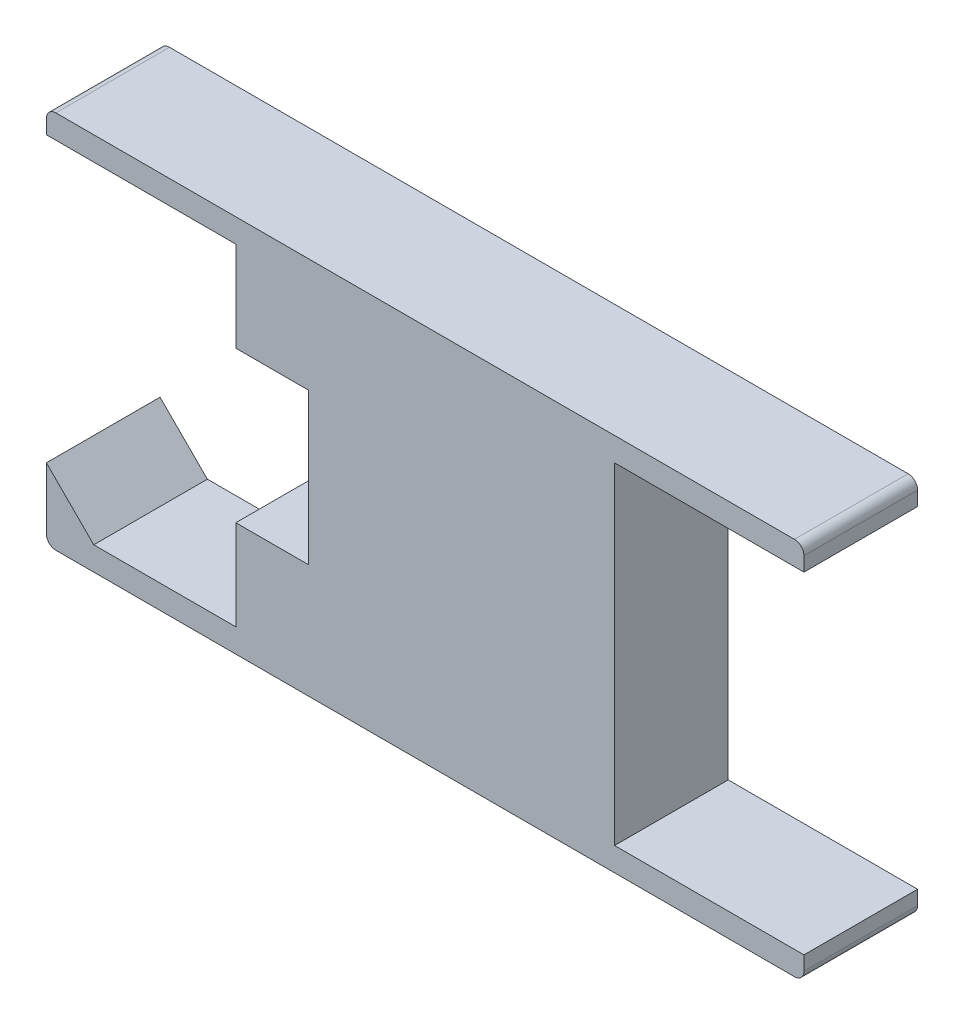
ISO-10303-21;
HEADER;
FILE_DESCRIPTION(('STEP AP214'),'2;1');
FILE_NAME('part.step','',(''),(''),'','','');
FILE_SCHEMA(('AUTOMOTIVE_DESIGN { 1 0 10303 214 1 1 1 1 }'));
ENDSEC;
DATA;
#1=APPLICATION_CONTEXT('core data for automotive mechanical design processes');
#2=APPLICATION_PROTOCOL_DEFINITION('international standard','automotive_design',2000,#1);
#3=PRODUCT_CONTEXT('',#1,'mechanical');
#4=PRODUCT('Part','Part','',(#3));
#5=PRODUCT_RELATED_PRODUCT_CATEGORY('part','',(#4));
#6=PRODUCT_DEFINITION_FORMATION('','',#4);
#7=PRODUCT_DEFINITION_CONTEXT('part definition',#1,'design');
#8=PRODUCT_DEFINITION('design','',#6,#7);
#9=PRODUCT_DEFINITION_SHAPE('','',#8);
#10=(LENGTH_UNIT() NAMED_UNIT(*) SI_UNIT(.MILLI.,.METRE.));
#11=(NAMED_UNIT(*) PLANE_ANGLE_UNIT() SI_UNIT($,.RADIAN.));
#12=(NAMED_UNIT(*) SI_UNIT($,.STERADIAN.) SOLID_ANGLE_UNIT());
#13=UNCERTAINTY_MEASURE_WITH_UNIT(LENGTH_MEASURE(1.E-05),#10,'distance_accuracy_value','');
#14=(GEOMETRIC_REPRESENTATION_CONTEXT(3) GLOBAL_UNCERTAINTY_ASSIGNED_CONTEXT((#13)) GLOBAL_UNIT_ASSIGNED_CONTEXT((#10,
#11,#12)) REPRESENTATION_CONTEXT('',''));
#15=CARTESIAN_POINT('',(0.,0.,0.));
#16=DIRECTION('',(0.,0.,1.));
#17=DIRECTION('',(1.,0.,0.));
#18=AXIS2_PLACEMENT_3D('',#15,#16,#17);
#19=CARTESIAN_POINT('',(0.78,-0.38,0.));
#20=DIRECTION('',(0.,0.,1.));
#21=DIRECTION('',(0.707106781186548,-0.707106781186548,0.));
#22=AXIS2_PLACEMENT_3D('',#19,#20,#21);
#23=CYLINDRICAL_SURFACE('',#22,0.02);
#24=CARTESIAN_POINT('',(0.78,-0.38,0.26));
#25=DIRECTION('',(0.,0.,-1.));
#26=DIRECTION('',(0.707106781186548,-0.707106781186548,0.));
#27=AXIS2_PLACEMENT_3D('',#24,#25,#26);
#28=CIRCLE('',#27,0.02);
#29=CARTESIAN_POINT('',(0.8,-0.38,0.26));
#30=VERTEX_POINT('',#29);
#31=CARTESIAN_POINT('',(0.78,-0.4,0.26));
#32=VERTEX_POINT('',#31);
#33=EDGE_CURVE('E11',#30,#32,#28,.T.);
#34=ORIENTED_EDGE('',*,*,#33,.T.);
#35=DIRECTION('',(0.,0.,-1.));
#36=VECTOR('',#35,1.);
#37=CARTESIAN_POINT('',(0.78,-0.4,0.));
#38=LINE('',#37,#36);
#39=CARTESIAN_POINT('',(0.78,-0.4,0.02));
#40=VERTEX_POINT('',#39);
#41=EDGE_CURVE('E28',#32,#40,#38,.T.);
#42=ORIENTED_EDGE('',*,*,#41,.T.);
#43=CARTESIAN_POINT('',(0.78,-0.38,0.02));
#44=DIRECTION('',(0.,0.,1.));
#45=DIRECTION('',(0.707106781186548,-0.707106781186548,0.));
#46=AXIS2_PLACEMENT_3D('',#43,#44,#45);
#47=CIRCLE('',#46,0.02);
#48=CARTESIAN_POINT('',(0.8,-0.38,0.02));
#49=VERTEX_POINT('',#48);
#50=EDGE_CURVE('E344',#40,#49,#47,.T.);
#51=ORIENTED_EDGE('',*,*,#50,.T.);
#52=DIRECTION('',(0.,0.,1.));
#53=VECTOR('',#52,1.);
#54=CARTESIAN_POINT('',(0.8,-0.38,0.));
#55=LINE('',#54,#53);
#56=EDGE_CURVE('E412',#49,#30,#55,.T.);
#57=ORIENTED_EDGE('',*,*,#56,.T.);
#58=EDGE_LOOP('',(#34,#42,#51,#57));
#59=FACE_BOUND('',#58,.T.);
#60=ADVANCED_FACE('F17',(#59),#23,.T.);
#61=CARTESIAN_POINT('',(-0.8,-0.4,0.));
#62=DIRECTION('',(0.,-1.,0.));
#63=DIRECTION('',(0.,0.,-1.));
#64=AXIS2_PLACEMENT_3D('',#61,#62,#63);
#65=PLANE('',#64);
#66=ORIENTED_EDGE('',*,*,#41,.F.);
#67=DIRECTION('',(-1.,0.,0.));
#68=VECTOR('',#67,1.);
#69=CARTESIAN_POINT('',(-0.4,-0.4,0.26));
#70=LINE('',#69,#68);
#71=CARTESIAN_POINT('',(-0.78,-0.4,0.26));
#72=VERTEX_POINT('',#71);
#73=EDGE_CURVE('E326',#32,#72,#70,.T.);
#74=ORIENTED_EDGE('',*,*,#73,.T.);
#75=DIRECTION('',(0.,0.,1.));
#76=VECTOR('',#75,1.);
#77=CARTESIAN_POINT('',(-0.78,-0.4,0.));
#78=LINE('',#77,#76);
#79=CARTESIAN_POINT('',(-0.78,-0.4,0.02));
#80=VERTEX_POINT('',#79);
#81=EDGE_CURVE('E267',#80,#72,#78,.T.);
#82=ORIENTED_EDGE('',*,*,#81,.F.);
#83=DIRECTION('',(1.,0.,0.));
#84=VECTOR('',#83,1.);
#85=CARTESIAN_POINT('',(-0.4,-0.4,0.02));
#86=LINE('',#85,#84);
#87=EDGE_CURVE('E323',#80,#40,#86,.T.);
#88=ORIENTED_EDGE('',*,*,#87,.T.);
#89=EDGE_LOOP('',(#66,#74,#82,#88));
#90=FACE_BOUND('',#89,.T.);
#91=ADVANCED_FACE('F504',(#90),#65,.T.);
#92=CARTESIAN_POINT('',(0.,0.,0.26));
#93=DIRECTION('',(0.,0.,-1.));
#94=DIRECTION('',(0.,-1.,0.));
#95=AXIS2_PLACEMENT_3D('',#92,#93,#94);
#96=PLANE('',#95);
#97=ORIENTED_EDGE('',*,*,#33,.F.);
#98=DIRECTION('',(0.,-1.,0.));
#99=VECTOR('',#98,1.);
#100=CARTESIAN_POINT('',(0.8,-0.2,0.26));
#101=LINE('',#100,#99);
#102=CARTESIAN_POINT('',(0.8,-0.35,0.26));
#103=VERTEX_POINT('',#102);
#104=EDGE_CURVE('E255',#103,#30,#101,.T.);
#105=ORIENTED_EDGE('',*,*,#104,.F.);
#106=DIRECTION('',(1.,0.,0.));
#107=VECTOR('',#106,1.);
#108=CARTESIAN_POINT('',(0.4,-0.35,0.26));
#109=LINE('',#108,#107);
#110=CARTESIAN_POINT('',(0.4,-0.35,0.26));
#111=VERTEX_POINT('',#110);
#112=EDGE_CURVE('E289',#111,#103,#109,.T.);
#113=ORIENTED_EDGE('',*,*,#112,.F.);
#114=DIRECTION('',(0.,-1.,0.));
#115=VECTOR('',#114,1.);
#116=CARTESIAN_POINT('',(0.4,-0.175,0.26));
#117=LINE('',#116,#115);
#118=CARTESIAN_POINT('',(0.4,0.35,0.26));
#119=VERTEX_POINT('',#118);
#120=EDGE_CURVE('E230',#119,#111,#117,.T.);
#121=ORIENTED_EDGE('',*,*,#120,.F.);
#122=DIRECTION('',(-1.,0.,0.));
#123=VECTOR('',#122,1.);
#124=CARTESIAN_POINT('',(0.2,0.35,0.26));
#125=LINE('',#124,#123);
#126=CARTESIAN_POINT('',(0.8,0.35,0.26));
#127=VERTEX_POINT('',#126);
#128=EDGE_CURVE('E217',#127,#119,#125,.T.);
#129=ORIENTED_EDGE('',*,*,#128,.F.);
#130=DIRECTION('',(0.,-1.,0.));
#131=VECTOR('',#130,1.);
#132=CARTESIAN_POINT('',(0.8,-0.2,0.26));
#133=LINE('',#132,#131);
#134=CARTESIAN_POINT('',(0.8,0.38,0.26));
#135=VERTEX_POINT('',#134);
#136=EDGE_CURVE('E290',#135,#127,#133,.T.);
#137=ORIENTED_EDGE('',*,*,#136,.F.);
#138=CARTESIAN_POINT('',(0.78,0.38,0.26));
#139=DIRECTION('',(0.,0.,-1.));
#140=DIRECTION('',(0.707106781186548,0.707106781186548,0.));
#141=AXIS2_PLACEMENT_3D('',#138,#139,#140);
#142=CIRCLE('',#141,0.02);
#143=CARTESIAN_POINT('',(0.78,0.4,0.26));
#144=VERTEX_POINT('',#143);
#145=EDGE_CURVE('E327',#144,#135,#142,.T.);
#146=ORIENTED_EDGE('',*,*,#145,.F.);
#147=DIRECTION('',(1.,0.,0.));
#148=VECTOR('',#147,1.);
#149=CARTESIAN_POINT('',(0.4,0.4,0.26));
#150=LINE('',#149,#148);
#151=CARTESIAN_POINT('',(-0.78,0.4,0.26));
#152=VERTEX_POINT('',#151);
#153=EDGE_CURVE('E331',#152,#144,#150,.T.);
#154=ORIENTED_EDGE('',*,*,#153,.F.);
#155=CARTESIAN_POINT('',(-0.78,0.38,0.26));
#156=DIRECTION('',(0.,0.,-1.));
#157=DIRECTION('',(-0.707106781186548,0.707106781186548,0.));
#158=AXIS2_PLACEMENT_3D('',#155,#156,#157);
#159=CIRCLE('',#158,0.02);
#160=CARTESIAN_POINT('',(-0.8,0.38,0.26));
#161=VERTEX_POINT('',#160);
#162=EDGE_CURVE('E316',#161,#152,#159,.T.);
#163=ORIENTED_EDGE('',*,*,#162,.F.);
#164=DIRECTION('',(0.,1.,0.));
#165=VECTOR('',#164,1.);
#166=CARTESIAN_POINT('',(-0.8,0.2,0.26));
#167=LINE('',#166,#165);
#168=CARTESIAN_POINT('',(-0.8,0.35,0.26));
#169=VERTEX_POINT('',#168);
#170=EDGE_CURVE('E337',#169,#161,#167,.T.);
#171=ORIENTED_EDGE('',*,*,#170,.F.);
#172=DIRECTION('',(-1.,0.,0.));
#173=VECTOR('',#172,1.);
#174=CARTESIAN_POINT('',(-0.4,0.35,0.26));
#175=LINE('',#174,#173);
#176=CARTESIAN_POINT('',(-0.4,0.35,0.26));
#177=VERTEX_POINT('',#176);
#178=EDGE_CURVE('E222',#177,#169,#175,.T.);
#179=ORIENTED_EDGE('',*,*,#178,.F.);
#180=DIRECTION('',(0.,1.,0.));
#181=VECTOR('',#180,1.);
#182=CARTESIAN_POINT('',(-0.4,0.175,0.26));
#183=LINE('',#182,#181);
#184=CARTESIAN_POINT('',(-0.4,0.159603540156,0.26));
#185=VERTEX_POINT('',#184);
#186=EDGE_CURVE('E246',#185,#177,#183,.T.);
#187=ORIENTED_EDGE('',*,*,#186,.F.);
#188=DIRECTION('',(-1.,0.,0.));
#189=VECTOR('',#188,1.);
#190=CARTESIAN_POINT('',(-0.2,0.159603540156,0.26));
#191=LINE('',#190,#189);
#192=CARTESIAN_POINT('',(-0.246794344933,0.159603540156,0.26));
#193=VERTEX_POINT('',#192);
#194=EDGE_CURVE('E365',#193,#185,#191,.T.);
#195=ORIENTED_EDGE('',*,*,#194,.F.);
#196=DIRECTION('',(0.,1.,0.));
#197=VECTOR('',#196,1.);
#198=CARTESIAN_POINT('',(-0.246794344933,0.07980177007817,0.26));
#199=LINE('',#198,#197);
#200=CARTESIAN_POINT('',(-0.246794344933,-0.159603540156,0.26));
#201=VERTEX_POINT('',#200);
#202=EDGE_CURVE('E300',#201,#193,#199,.T.);
#203=ORIENTED_EDGE('',*,*,#202,.F.);
#204=DIRECTION('',(1.,0.,0.));
#205=VECTOR('',#204,1.);
#206=CARTESIAN_POINT('',(-0.123397172466,-0.159603540156,0.26));
#207=LINE('',#206,#205);
#208=CARTESIAN_POINT('',(-0.4,-0.159603540156,0.26));
#209=VERTEX_POINT('',#208);
#210=EDGE_CURVE('E153',#209,#201,#207,.T.);
#211=ORIENTED_EDGE('',*,*,#210,.F.);
#212=DIRECTION('',(0.,1.,0.));
#213=VECTOR('',#212,1.);
#214=CARTESIAN_POINT('',(-0.4,-0.07980177007817,0.26));
#215=LINE('',#214,#213);
#216=CARTESIAN_POINT('',(-0.4,-0.35,0.26));
#217=VERTEX_POINT('',#216);
#218=EDGE_CURVE('E160',#217,#209,#215,.T.);
#219=ORIENTED_EDGE('',*,*,#218,.F.);
#220=DIRECTION('',(1.,0.,0.));
#221=VECTOR('',#220,1.);
#222=CARTESIAN_POINT('',(-0.2,-0.35,0.26));
#223=LINE('',#222,#221);
#224=CARTESIAN_POINT('',(-0.7,-0.35,0.26));
#225=VERTEX_POINT('',#224);
#226=EDGE_CURVE('E256',#225,#217,#223,.T.);
#227=ORIENTED_EDGE('',*,*,#226,.F.);
#228=DIRECTION('',(0.707106781186548,-0.707106781186548,0.));
#229=VECTOR('',#228,1.);
#230=CARTESIAN_POINT('',(-0.6125,-0.4375,0.26));
#231=LINE('',#230,#229);
#232=CARTESIAN_POINT('',(-0.8,-0.25,0.26));
#233=VERTEX_POINT('',#232);
#234=EDGE_CURVE('E251',#233,#225,#231,.T.);
#235=ORIENTED_EDGE('',*,*,#234,.F.);
#236=DIRECTION('',(0.,1.,0.));
#237=VECTOR('',#236,1.);
#238=CARTESIAN_POINT('',(-0.8,0.2,0.26));
#239=LINE('',#238,#237);
#240=CARTESIAN_POINT('',(-0.8,-0.38,0.26));
#241=VERTEX_POINT('',#240);
#242=EDGE_CURVE('E399',#241,#233,#239,.T.);
#243=ORIENTED_EDGE('',*,*,#242,.F.);
#244=CARTESIAN_POINT('',(-0.78,-0.38,0.26));
#245=DIRECTION('',(0.,0.,-1.));
#246=DIRECTION('',(-0.707106781186548,-0.707106781186548,0.));
#247=AXIS2_PLACEMENT_3D('',#244,#245,#246);
#248=CIRCLE('',#247,0.02);
#249=EDGE_CURVE('E21',#72,#241,#248,.T.);
#250=ORIENTED_EDGE('',*,*,#249,.F.);
#251=ORIENTED_EDGE('',*,*,#73,.F.);
#252=EDGE_LOOP('',(#97,#105,#113,#121,#129,#137,#146,#154,#163,#171,#179,#187,#195,#203,#211,
#219,#227,#235,#243,#250,#251));
#253=FACE_BOUND('',#252,.T.);
#254=ADVANCED_FACE('F445',(#253),#96,.F.);
#255=CARTESIAN_POINT('',(0.78,0.38,0.));
#256=DIRECTION('',(0.,0.,1.));
#257=DIRECTION('',(0.707106781186548,0.707106781186548,0.));
#258=AXIS2_PLACEMENT_3D('',#255,#256,#257);
#259=CYLINDRICAL_SURFACE('',#258,0.02);
#260=ORIENTED_EDGE('',*,*,#145,.T.);
#261=DIRECTION('',(0.,0.,-1.));
#262=VECTOR('',#261,1.);
#263=CARTESIAN_POINT('',(0.8,0.38,0.));
#264=LINE('',#263,#262);
#265=CARTESIAN_POINT('',(0.8,0.38,0.02));
#266=VERTEX_POINT('',#265);
#267=EDGE_CURVE('E383',#135,#266,#264,.T.);
#268=ORIENTED_EDGE('',*,*,#267,.T.);
#269=CARTESIAN_POINT('',(0.78,0.38,0.02));
#270=DIRECTION('',(0.,0.,1.));
#271=DIRECTION('',(0.707106781186548,0.707106781186548,0.));
#272=AXIS2_PLACEMENT_3D('',#269,#270,#271);
#273=CIRCLE('',#272,0.02);
#274=CARTESIAN_POINT('',(0.78,0.4,0.02));
#275=VERTEX_POINT('',#274);
#276=EDGE_CURVE('E275',#266,#275,#273,.T.);
#277=ORIENTED_EDGE('',*,*,#276,.T.);
#278=DIRECTION('',(0.,0.,1.));
#279=VECTOR('',#278,1.);
#280=CARTESIAN_POINT('',(0.78,0.4,0.));
#281=LINE('',#280,#279);
#282=EDGE_CURVE('E271',#275,#144,#281,.T.);
#283=ORIENTED_EDGE('',*,*,#282,.T.);
#284=EDGE_LOOP('',(#260,#268,#277,#283));
#285=FACE_BOUND('',#284,.T.);
#286=ADVANCED_FACE('F442',(#285),#259,.T.);
#287=CARTESIAN_POINT('',(0.8,0.4,0.));
#288=DIRECTION('',(0.,1.,0.));
#289=DIRECTION('',(1.,0.,0.));
#290=AXIS2_PLACEMENT_3D('',#287,#288,#289);
#291=PLANE('',#290);
#292=ORIENTED_EDGE('',*,*,#282,.F.);
#293=DIRECTION('',(-1.,0.,0.));
#294=VECTOR('',#293,1.);
#295=CARTESIAN_POINT('',(0.4,0.4,0.02));
#296=LINE('',#295,#294);
#297=CARTESIAN_POINT('',(-0.78,0.4,0.02));
#298=VERTEX_POINT('',#297);
#299=EDGE_CURVE('E276',#275,#298,#296,.T.);
#300=ORIENTED_EDGE('',*,*,#299,.T.);
#301=DIRECTION('',(0.,0.,-1.));
#302=VECTOR('',#301,1.);
#303=CARTESIAN_POINT('',(-0.78,0.4,0.));
#304=LINE('',#303,#302);
#305=EDGE_CURVE('E314',#152,#298,#304,.T.);
#306=ORIENTED_EDGE('',*,*,#305,.F.);
#307=ORIENTED_EDGE('',*,*,#153,.T.);
#308=EDGE_LOOP('',(#292,#300,#306,#307));
#309=FACE_BOUND('',#308,.T.);
#310=ADVANCED_FACE('F490',(#309),#291,.T.);
#311=CARTESIAN_POINT('',(-0.78,0.38,0.));
#312=DIRECTION('',(0.,0.,1.));
#313=DIRECTION('',(-0.707106781186548,0.707106781186548,0.));
#314=AXIS2_PLACEMENT_3D('',#311,#312,#313);
#315=CYLINDRICAL_SURFACE('',#314,0.02);
#316=ORIENTED_EDGE('',*,*,#162,.T.);
#317=ORIENTED_EDGE('',*,*,#305,.T.);
#318=CARTESIAN_POINT('',(-0.78,0.38,0.02));
#319=DIRECTION('',(0.,0.,1.));
#320=DIRECTION('',(-0.707106781186548,0.707106781186548,0.));
#321=AXIS2_PLACEMENT_3D('',#318,#319,#320);
#322=CIRCLE('',#321,0.02);
#323=CARTESIAN_POINT('',(-0.8,0.38,0.02));
#324=VERTEX_POINT('',#323);
#325=EDGE_CURVE('E313',#298,#324,#322,.T.);
#326=ORIENTED_EDGE('',*,*,#325,.T.);
#327=DIRECTION('',(0.,0.,1.));
#328=VECTOR('',#327,1.);
#329=CARTESIAN_POINT('',(-0.8,0.38,0.));
#330=LINE('',#329,#328);
#331=EDGE_CURVE('E309',#324,#161,#330,.T.);
#332=ORIENTED_EDGE('',*,*,#331,.T.);
#333=EDGE_LOOP('',(#316,#317,#326,#332));
#334=FACE_BOUND('',#333,.T.);
#335=ADVANCED_FACE('F480',(#334),#315,.T.);
#336=CARTESIAN_POINT('',(-0.78,-0.38,0.));
#337=DIRECTION('',(0.,0.,1.));
#338=DIRECTION('',(-0.707106781186548,-0.707106781186548,0.));
#339=AXIS2_PLACEMENT_3D('',#336,#337,#338);
#340=CYLINDRICAL_SURFACE('',#339,0.02);
#341=ORIENTED_EDGE('',*,*,#249,.T.);
#342=DIRECTION('',(0.,0.,-1.));
#343=VECTOR('',#342,1.);
#344=CARTESIAN_POINT('',(-0.8,-0.38,0.));
#345=LINE('',#344,#343);
#346=CARTESIAN_POINT('',(-0.8,-0.38,0.02));
#347=VERTEX_POINT('',#346);
#348=EDGE_CURVE('E266',#241,#347,#345,.T.);
#349=ORIENTED_EDGE('',*,*,#348,.T.);
#350=CARTESIAN_POINT('',(-0.78,-0.38,0.02));
#351=DIRECTION('',(0.,0.,1.));
#352=DIRECTION('',(-0.707106781186548,-0.707106781186548,0.));
#353=AXIS2_PLACEMENT_3D('',#350,#351,#352);
#354=CIRCLE('',#353,0.02);
#355=EDGE_CURVE('E262',#347,#80,#354,.T.);
#356=ORIENTED_EDGE('',*,*,#355,.T.);
#357=ORIENTED_EDGE('',*,*,#81,.T.);
#358=EDGE_LOOP('',(#341,#349,#356,#357));
#359=FACE_BOUND('',#358,.T.);
#360=ADVANCED_FACE('F498',(#359),#340,.T.);
#361=CARTESIAN_POINT('',(-0.8,0.4,0.));
#362=DIRECTION('',(-1.,0.,0.));
#363=DIRECTION('',(0.,0.,1.));
#364=AXIS2_PLACEMENT_3D('',#361,#362,#363);
#365=PLANE('',#364);
#366=ORIENTED_EDGE('',*,*,#348,.F.);
#367=ORIENTED_EDGE('',*,*,#242,.T.);
#368=DIRECTION('',(0.,0.,-1.));
#369=VECTOR('',#368,1.);
#370=CARTESIAN_POINT('',(-0.8,-0.25,0.));
#371=LINE('',#370,#369);
#372=CARTESIAN_POINT('',(-0.8,-0.25,0.02));
#373=VERTEX_POINT('',#372);
#374=EDGE_CURVE('E308',#233,#373,#371,.T.);
#375=ORIENTED_EDGE('',*,*,#374,.T.);
#376=DIRECTION('',(0.,-1.,0.));
#377=VECTOR('',#376,1.);
#378=CARTESIAN_POINT('',(-0.8,0.2,0.02));
#379=LINE('',#378,#377);
#380=EDGE_CURVE('E304',#373,#347,#379,.T.);
#381=ORIENTED_EDGE('',*,*,#380,.T.);
#382=EDGE_LOOP('',(#366,#367,#375,#381));
#383=FACE_BOUND('',#382,.T.);
#384=ADVANCED_FACE('F556',(#383),#365,.T.);
#385=CARTESIAN_POINT('',(0.8,-0.35,0.));
#386=DIRECTION('',(0.,-1.,0.));
#387=DIRECTION('',(0.,0.,-1.));
#388=AXIS2_PLACEMENT_3D('',#385,#386,#387);
#389=PLANE('',#388);
#390=ORIENTED_EDGE('',*,*,#112,.T.);
#391=DIRECTION('',(0.,0.,1.));
#392=VECTOR('',#391,1.);
#393=CARTESIAN_POINT('',(0.8,-0.35,0.));
#394=LINE('',#393,#392);
#395=CARTESIAN_POINT('',(0.8,-0.35,0.02));
#396=VERTEX_POINT('',#395);
#397=EDGE_CURVE('E284',#396,#103,#394,.T.);
#398=ORIENTED_EDGE('',*,*,#397,.F.);
#399=DIRECTION('',(1.,0.,0.));
#400=VECTOR('',#399,1.);
#401=CARTESIAN_POINT('',(0.8,-0.35,0.02));
#402=LINE('',#401,#400);
#403=CARTESIAN_POINT('',(0.4,-0.35,0.02));
#404=VERTEX_POINT('',#403);
#405=EDGE_CURVE('E395',#404,#396,#402,.T.);
#406=ORIENTED_EDGE('',*,*,#405,.F.);
#407=DIRECTION('',(0.,0.,-1.));
#408=VECTOR('',#407,1.);
#409=CARTESIAN_POINT('',(0.4,-0.35,0.));
#410=LINE('',#409,#408);
#411=EDGE_CURVE('E235',#111,#404,#410,.T.);
#412=ORIENTED_EDGE('',*,*,#411,.F.);
#413=EDGE_LOOP('',(#390,#398,#406,#412));
#414=FACE_BOUND('',#413,.T.);
#415=ADVANCED_FACE('F408',(#414),#389,.F.);
#416=CARTESIAN_POINT('',(0.8,-0.4,0.));
#417=DIRECTION('',(1.,0.,0.));
#418=DIRECTION('',(0.,1.,0.));
#419=AXIS2_PLACEMENT_3D('',#416,#417,#418);
#420=PLANE('',#419);
#421=ORIENTED_EDGE('',*,*,#56,.F.);
#422=DIRECTION('',(0.,1.,0.));
#423=VECTOR('',#422,1.);
#424=CARTESIAN_POINT('',(0.8,-0.2,0.02));
#425=LINE('',#424,#423);
#426=EDGE_CURVE('E285',#49,#396,#425,.T.);
#427=ORIENTED_EDGE('',*,*,#426,.T.);
#428=ORIENTED_EDGE('',*,*,#397,.T.);
#429=ORIENTED_EDGE('',*,*,#104,.T.);
#430=EDGE_LOOP('',(#421,#427,#428,#429));
#431=FACE_BOUND('',#430,.T.);
#432=ADVANCED_FACE('F411',(#431),#420,.T.);
#433=CARTESIAN_POINT('',(-0.7,-0.35,0.));
#434=DIRECTION('',(-0.707106781186548,-0.707106781186548,0.));
#435=DIRECTION('',(-0.707106781186548,0.707106781186548,0.));
#436=AXIS2_PLACEMENT_3D('',#433,#434,#435);
#437=PLANE('',#436);
#438=ORIENTED_EDGE('',*,*,#234,.T.);
#439=DIRECTION('',(0.,0.,1.));
#440=VECTOR('',#439,1.);
#441=CARTESIAN_POINT('',(-0.7,-0.35,0.));
#442=LINE('',#441,#440);
#443=CARTESIAN_POINT('',(-0.7,-0.35,0.02));
#444=VERTEX_POINT('',#443);
#445=EDGE_CURVE('E371',#444,#225,#442,.T.);
#446=ORIENTED_EDGE('',*,*,#445,.F.);
#447=DIRECTION('',(0.707106781186548,-0.707106781186548,0.));
#448=VECTOR('',#447,1.);
#449=CARTESIAN_POINT('',(-0.6375,-0.4125,0.02));
#450=LINE('',#449,#448);
#451=EDGE_CURVE('E340',#373,#444,#450,.T.);
#452=ORIENTED_EDGE('',*,*,#451,.F.);
#453=ORIENTED_EDGE('',*,*,#374,.F.);
#454=EDGE_LOOP('',(#438,#446,#452,#453));
#455=FACE_BOUND('',#454,.T.);
#456=ADVANCED_FACE('F511',(#455),#437,.F.);
#457=CARTESIAN_POINT('',(-0.4,-0.35,0.));
#458=DIRECTION('',(0.,-1.,0.));
#459=DIRECTION('',(-1.,0.,0.));
#460=AXIS2_PLACEMENT_3D('',#457,#458,#459);
#461=PLANE('',#460);
#462=ORIENTED_EDGE('',*,*,#226,.T.);
#463=DIRECTION('',(0.,0.,1.));
#464=VECTOR('',#463,1.);
#465=CARTESIAN_POINT('',(-0.4,-0.35,0.));
#466=LINE('',#465,#464);
#467=CARTESIAN_POINT('',(-0.4,-0.35,0.02));
#468=VERTEX_POINT('',#467);
#469=EDGE_CURVE('E380',#468,#217,#466,.T.);
#470=ORIENTED_EDGE('',*,*,#469,.F.);
#471=DIRECTION('',(1.,0.,0.));
#472=VECTOR('',#471,1.);
#473=CARTESIAN_POINT('',(0.8,-0.35,0.02));
#474=LINE('',#473,#472);
#475=EDGE_CURVE('E260',#444,#468,#474,.T.);
#476=ORIENTED_EDGE('',*,*,#475,.F.);
#477=ORIENTED_EDGE('',*,*,#445,.T.);
#478=EDGE_LOOP('',(#462,#470,#476,#477));
#479=FACE_BOUND('',#478,.T.);
#480=ADVANCED_FACE('F535',(#479),#461,.F.);
#481=CARTESIAN_POINT('',(-0.4,-0.159603540156,0.));
#482=DIRECTION('',(1.,0.,0.));
#483=DIRECTION('',(0.,1.,0.));
#484=AXIS2_PLACEMENT_3D('',#481,#482,#483);
#485=PLANE('',#484);
#486=ORIENTED_EDGE('',*,*,#218,.T.);
#487=DIRECTION('',(0.,0.,-1.));
#488=VECTOR('',#487,1.);
#489=CARTESIAN_POINT('',(-0.4,-0.159603540156,0.));
#490=LINE('',#489,#488);
#491=CARTESIAN_POINT('',(-0.4,-0.159603540156,0.02));
#492=VERTEX_POINT('',#491);
#493=EDGE_CURVE('E379',#209,#492,#490,.T.);
#494=ORIENTED_EDGE('',*,*,#493,.T.);
#495=DIRECTION('',(0.,-1.,0.));
#496=VECTOR('',#495,1.);
#497=CARTESIAN_POINT('',(-0.4,-0.503670619885,0.02));
#498=LINE('',#497,#496);
#499=EDGE_CURVE('E375',#492,#468,#498,.T.);
#500=ORIENTED_EDGE('',*,*,#499,.T.);
#501=ORIENTED_EDGE('',*,*,#469,.T.);
#502=EDGE_LOOP('',(#486,#494,#500,#501));
#503=FACE_BOUND('',#502,.T.);
#504=ADVANCED_FACE('F528',(#503),#485,.F.);
#505=CARTESIAN_POINT('',(-0.246794344933,-0.159603540156,0.));
#506=DIRECTION('',(0.,-1.,0.));
#507=DIRECTION('',(0.,0.,-1.));
#508=AXIS2_PLACEMENT_3D('',#505,#506,#507);
#509=PLANE('',#508);
#510=ORIENTED_EDGE('',*,*,#210,.T.);
#511=DIRECTION('',(0.,0.,1.));
#512=VECTOR('',#511,1.);
#513=CARTESIAN_POINT('',(-0.246794344933,-0.159603540156,0.));
#514=LINE('',#513,#512);
#515=CARTESIAN_POINT('',(-0.246794344933,-0.159603540156,0.02));
#516=VERTEX_POINT('',#515);
#517=EDGE_CURVE('E245',#516,#201,#514,.T.);
#518=ORIENTED_EDGE('',*,*,#517,.F.);
#519=DIRECTION('',(1.,0.,0.));
#520=VECTOR('',#519,1.);
#521=CARTESIAN_POINT('',(-0.276602827534,-0.159603540156,0.02));
#522=LINE('',#521,#520);
#523=EDGE_CURVE('E257',#492,#516,#522,.T.);
#524=ORIENTED_EDGE('',*,*,#523,.F.);
#525=ORIENTED_EDGE('',*,*,#493,.F.);
#526=EDGE_LOOP('',(#510,#518,#524,#525));
#527=FACE_BOUND('',#526,.T.);
#528=ADVANCED_FACE('F526',(#527),#509,.F.);
#529=CARTESIAN_POINT('',(0.4,0.35,0.));
#530=DIRECTION('',(0.,1.,0.));
#531=DIRECTION('',(1.,0.,0.));
#532=AXIS2_PLACEMENT_3D('',#529,#530,#531);
#533=PLANE('',#532);
#534=ORIENTED_EDGE('',*,*,#128,.T.);
#535=DIRECTION('',(0.,0.,1.));
#536=VECTOR('',#535,1.);
#537=CARTESIAN_POINT('',(0.4,0.35,0.));
#538=LINE('',#537,#536);
#539=CARTESIAN_POINT('',(0.4,0.35,0.02));
#540=VERTEX_POINT('',#539);
#541=EDGE_CURVE('E210',#540,#119,#538,.T.);
#542=ORIENTED_EDGE('',*,*,#541,.F.);
#543=DIRECTION('',(1.,0.,0.));
#544=VECTOR('',#543,1.);
#545=CARTESIAN_POINT('',(0.8,0.35,0.02));
#546=LINE('',#545,#544);
#547=CARTESIAN_POINT('',(0.8,0.35,0.02));
#548=VERTEX_POINT('',#547);
#549=EDGE_CURVE('E214',#540,#548,#546,.T.);
#550=ORIENTED_EDGE('',*,*,#549,.T.);
#551=DIRECTION('',(0.,0.,-1.));
#552=VECTOR('',#551,1.);
#553=CARTESIAN_POINT('',(0.8,0.35,0.));
#554=LINE('',#553,#552);
#555=EDGE_CURVE('E294',#127,#548,#554,.T.);
#556=ORIENTED_EDGE('',*,*,#555,.F.);
#557=EDGE_LOOP('',(#534,#542,#550,#556));
#558=FACE_BOUND('',#557,.T.);
#559=ADVANCED_FACE('F212',(#558),#533,.F.);
#560=CARTESIAN_POINT('',(0.4,-0.35,0.));
#561=DIRECTION('',(-1.,0.,0.));
#562=DIRECTION('',(0.,0.,1.));
#563=AXIS2_PLACEMENT_3D('',#560,#561,#562);
#564=PLANE('',#563);
#565=ORIENTED_EDGE('',*,*,#120,.T.);
#566=ORIENTED_EDGE('',*,*,#411,.T.);
#567=DIRECTION('',(0.,1.,0.));
#568=VECTOR('',#567,1.);
#569=CARTESIAN_POINT('',(0.4,0.503670619885,0.02));
#570=LINE('',#569,#568);
#571=EDGE_CURVE('E221',#404,#540,#570,.T.);
#572=ORIENTED_EDGE('',*,*,#571,.T.);
#573=ORIENTED_EDGE('',*,*,#541,.T.);
#574=EDGE_LOOP('',(#565,#566,#572,#573));
#575=FACE_BOUND('',#574,.T.);
#576=ADVANCED_FACE('F233',(#575),#564,.F.);
#577=CARTESIAN_POINT('',(-0.8,0.35,0.));
#578=DIRECTION('',(0.,1.,0.));
#579=DIRECTION('',(1.,0.,0.));
#580=AXIS2_PLACEMENT_3D('',#577,#578,#579);
#581=PLANE('',#580);
#582=ORIENTED_EDGE('',*,*,#178,.T.);
#583=DIRECTION('',(0.,0.,1.));
#584=VECTOR('',#583,1.);
#585=CARTESIAN_POINT('',(-0.8,0.35,0.));
#586=LINE('',#585,#584);
#587=CARTESIAN_POINT('',(-0.8,0.35,0.02));
#588=VERTEX_POINT('',#587);
#589=EDGE_CURVE('E332',#588,#169,#586,.T.);
#590=ORIENTED_EDGE('',*,*,#589,.F.);
#591=DIRECTION('',(1.,0.,0.));
#592=VECTOR('',#591,1.);
#593=CARTESIAN_POINT('',(0.8,0.35,0.02));
#594=LINE('',#593,#592);
#595=CARTESIAN_POINT('',(-0.4,0.35,0.02));
#596=VERTEX_POINT('',#595);
#597=EDGE_CURVE('E299',#588,#596,#594,.T.);
#598=ORIENTED_EDGE('',*,*,#597,.T.);
#599=DIRECTION('',(0.,0.,1.));
#600=VECTOR('',#599,1.);
#601=CARTESIAN_POINT('',(-0.4,0.35,0.));
#602=LINE('',#601,#600);
#603=EDGE_CURVE('E295',#596,#177,#602,.T.);
#604=ORIENTED_EDGE('',*,*,#603,.T.);
#605=EDGE_LOOP('',(#582,#590,#598,#604));
#606=FACE_BOUND('',#605,.T.);
#607=ADVANCED_FACE('F486',(#606),#581,.F.);
#608=CARTESIAN_POINT('',(-0.246794344933,0.159603540156,0.));
#609=DIRECTION('',(1.,0.,0.));
#610=DIRECTION('',(0.,1.,0.));
#611=AXIS2_PLACEMENT_3D('',#608,#609,#610);
#612=PLANE('',#611);
#613=ORIENTED_EDGE('',*,*,#202,.T.);
#614=DIRECTION('',(0.,0.,1.));
#615=VECTOR('',#614,1.);
#616=CARTESIAN_POINT('',(-0.246794344933,0.159603540156,0.));
#617=LINE('',#616,#615);
#618=CARTESIAN_POINT('',(-0.246794344933,0.159603540156,0.02));
#619=VERTEX_POINT('',#618);
#620=EDGE_CURVE('E249',#619,#193,#617,.T.);
#621=ORIENTED_EDGE('',*,*,#620,.F.);
#622=DIRECTION('',(0.,1.,0.));
#623=VECTOR('',#622,1.);
#624=CARTESIAN_POINT('',(-0.246794344933,-0.07980177007817,0.02));
#625=LINE('',#624,#623);
#626=EDGE_CURVE('E261',#516,#619,#625,.T.);
#627=ORIENTED_EDGE('',*,*,#626,.F.);
#628=ORIENTED_EDGE('',*,*,#517,.T.);
#629=EDGE_LOOP('',(#613,#621,#627,#628));
#630=FACE_BOUND('',#629,.T.);
#631=ADVANCED_FACE('F520',(#630),#612,.F.);
#632=CARTESIAN_POINT('',(-0.4,0.159603540156,0.));
#633=DIRECTION('',(0.,1.,0.));
#634=DIRECTION('',(1.,0.,0.));
#635=AXIS2_PLACEMENT_3D('',#632,#633,#634);
#636=PLANE('',#635);
#637=ORIENTED_EDGE('',*,*,#194,.T.);
#638=DIRECTION('',(0.,0.,1.));
#639=VECTOR('',#638,1.);
#640=CARTESIAN_POINT('',(-0.4,0.159603540156,0.));
#641=LINE('',#640,#639);
#642=CARTESIAN_POINT('',(-0.4,0.159603540156,0.02));
#643=VERTEX_POINT('',#642);
#644=EDGE_CURVE('E280',#643,#185,#641,.T.);
#645=ORIENTED_EDGE('',*,*,#644,.F.);
#646=DIRECTION('',(-1.,0.,0.));
#647=VECTOR('',#646,1.);
#648=CARTESIAN_POINT('',(-0.123397172466,0.159603540156,0.02));
#649=LINE('',#648,#647);
#650=EDGE_CURVE('E269',#619,#643,#649,.T.);
#651=ORIENTED_EDGE('',*,*,#650,.F.);
#652=ORIENTED_EDGE('',*,*,#620,.T.);
#653=EDGE_LOOP('',(#637,#645,#651,#652));
#654=FACE_BOUND('',#653,.T.);
#655=ADVANCED_FACE('F516',(#654),#636,.F.);
#656=CARTESIAN_POINT('',(-0.4,0.35,0.));
#657=DIRECTION('',(1.,0.,0.));
#658=DIRECTION('',(0.,1.,0.));
#659=AXIS2_PLACEMENT_3D('',#656,#657,#658);
#660=PLANE('',#659);
#661=ORIENTED_EDGE('',*,*,#186,.T.);
#662=ORIENTED_EDGE('',*,*,#603,.F.);
#663=DIRECTION('',(0.,-1.,0.));
#664=VECTOR('',#663,1.);
#665=CARTESIAN_POINT('',(-0.4,-0.503670619885,0.02));
#666=LINE('',#665,#664);
#667=EDGE_CURVE('E250',#596,#643,#666,.T.);
#668=ORIENTED_EDGE('',*,*,#667,.T.);
#669=ORIENTED_EDGE('',*,*,#644,.T.);
#670=EDGE_LOOP('',(#661,#662,#668,#669));
#671=FACE_BOUND('',#670,.T.);
#672=ADVANCED_FACE('F519',(#671),#660,.F.);
#673=CARTESIAN_POINT('',(0.8,-0.4,0.));
#674=DIRECTION('',(1.,0.,0.));
#675=DIRECTION('',(0.,1.,0.));
#676=AXIS2_PLACEMENT_3D('',#673,#674,#675);
#677=PLANE('',#676);
#678=ORIENTED_EDGE('',*,*,#267,.F.);
#679=ORIENTED_EDGE('',*,*,#136,.T.);
#680=ORIENTED_EDGE('',*,*,#555,.T.);
#681=DIRECTION('',(0.,1.,0.));
#682=VECTOR('',#681,1.);
#683=CARTESIAN_POINT('',(0.8,-0.2,0.02));
#684=LINE('',#683,#682);
#685=EDGE_CURVE('E228',#548,#266,#684,.T.);
#686=ORIENTED_EDGE('',*,*,#685,.T.);
#687=EDGE_LOOP('',(#678,#679,#680,#686));
#688=FACE_BOUND('',#687,.T.);
#689=ADVANCED_FACE('F444',(#688),#677,.T.);
#690=CARTESIAN_POINT('',(-0.8,0.4,0.));
#691=DIRECTION('',(-1.,0.,0.));
#692=DIRECTION('',(0.,0.,1.));
#693=AXIS2_PLACEMENT_3D('',#690,#691,#692);
#694=PLANE('',#693);
#695=ORIENTED_EDGE('',*,*,#331,.F.);
#696=DIRECTION('',(0.,-1.,0.));
#697=VECTOR('',#696,1.);
#698=CARTESIAN_POINT('',(-0.8,0.2,0.02));
#699=LINE('',#698,#697);
#700=EDGE_CURVE('E336',#324,#588,#699,.T.);
#701=ORIENTED_EDGE('',*,*,#700,.T.);
#702=ORIENTED_EDGE('',*,*,#589,.T.);
#703=ORIENTED_EDGE('',*,*,#170,.T.);
#704=EDGE_LOOP('',(#695,#701,#702,#703));
#705=FACE_BOUND('',#704,.T.);
#706=ADVANCED_FACE('F19',(#705),#694,.T.);
#707=CARTESIAN_POINT('',(0.,0.,0.02));
#708=DIRECTION('',(0.,0.,1.));
#709=DIRECTION('',(1.,0.,0.));
#710=AXIS2_PLACEMENT_3D('',#707,#708,#709);
#711=PLANE('',#710);
#712=ORIENTED_EDGE('',*,*,#50,.F.);
#713=ORIENTED_EDGE('',*,*,#87,.F.);
#714=ORIENTED_EDGE('',*,*,#355,.F.);
#715=ORIENTED_EDGE('',*,*,#380,.F.);
#716=ORIENTED_EDGE('',*,*,#451,.T.);
#717=ORIENTED_EDGE('',*,*,#475,.T.);
#718=ORIENTED_EDGE('',*,*,#499,.F.);
#719=ORIENTED_EDGE('',*,*,#523,.T.);
#720=ORIENTED_EDGE('',*,*,#626,.T.);
#721=ORIENTED_EDGE('',*,*,#650,.T.);
#722=ORIENTED_EDGE('',*,*,#667,.F.);
#723=ORIENTED_EDGE('',*,*,#597,.F.);
#724=ORIENTED_EDGE('',*,*,#700,.F.);
#725=ORIENTED_EDGE('',*,*,#325,.F.);
#726=ORIENTED_EDGE('',*,*,#299,.F.);
#727=ORIENTED_EDGE('',*,*,#276,.F.);
#728=ORIENTED_EDGE('',*,*,#685,.F.);
#729=ORIENTED_EDGE('',*,*,#549,.F.);
#730=ORIENTED_EDGE('',*,*,#571,.F.);
#731=ORIENTED_EDGE('',*,*,#405,.T.);
#732=ORIENTED_EDGE('',*,*,#426,.F.);
#733=EDGE_LOOP('',(#712,#713,#714,#715,#716,#717,#718,#719,#720,#721,#722,#723,#724,#725,#726,
#727,#728,#729,#730,#731,#732));
#734=FACE_BOUND('',#733,.T.);
#735=ADVANCED_FACE('F226',(#734),#711,.F.);
#736=CLOSED_SHELL('',(#60,#91,#254,#286,#310,#335,#360,#384,#415,#432,#456,#480,#504,#528,#559,
#576,#607,#631,#655,#672,#689,#706,#735));
#737=MANIFOLD_SOLID_BREP('B1',#736);
#738=ADVANCED_BREP_SHAPE_REPRESENTATION('',(#18,#737),#14);
#739=SHAPE_DEFINITION_REPRESENTATION(#9,#738);
ENDSEC;
END-ISO-10303-21;
